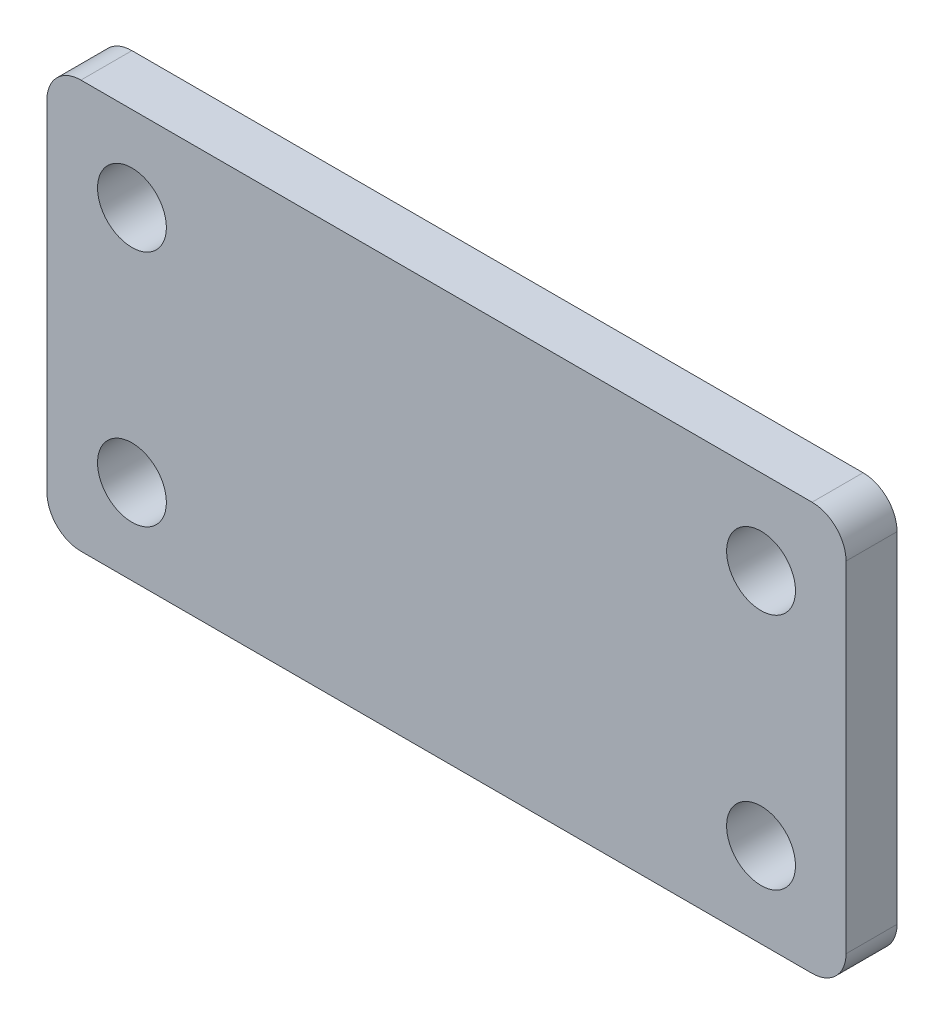
ISO-10303-21;
HEADER;
FILE_DESCRIPTION(('STEP AP214'),'2;1');
FILE_NAME('part.step','',(''),(''),'','','');
FILE_SCHEMA(('AUTOMOTIVE_DESIGN { 1 0 10303 214 1 1 1 1 }'));
ENDSEC;
DATA;
#1=APPLICATION_CONTEXT('core data for automotive mechanical design processes');
#2=APPLICATION_PROTOCOL_DEFINITION('international standard','automotive_design',2000,#1);
#3=PRODUCT_CONTEXT('',#1,'mechanical');
#4=PRODUCT('Part','Part','',(#3));
#5=PRODUCT_RELATED_PRODUCT_CATEGORY('part','',(#4));
#6=PRODUCT_DEFINITION_FORMATION('','',#4);
#7=PRODUCT_DEFINITION_CONTEXT('part definition',#1,'design');
#8=PRODUCT_DEFINITION('design','',#6,#7);
#9=PRODUCT_DEFINITION_SHAPE('','',#8);
#10=(LENGTH_UNIT() NAMED_UNIT(*) SI_UNIT(.MILLI.,.METRE.));
#11=(NAMED_UNIT(*) PLANE_ANGLE_UNIT() SI_UNIT($,.RADIAN.));
#12=(NAMED_UNIT(*) SI_UNIT($,.STERADIAN.) SOLID_ANGLE_UNIT());
#13=UNCERTAINTY_MEASURE_WITH_UNIT(LENGTH_MEASURE(1.E-05),#10,'distance_accuracy_value','');
#14=(GEOMETRIC_REPRESENTATION_CONTEXT(3) GLOBAL_UNCERTAINTY_ASSIGNED_CONTEXT((#13)) GLOBAL_UNIT_ASSIGNED_CONTEXT((#10,
#11,#12)) REPRESENTATION_CONTEXT('',''));
#15=CARTESIAN_POINT('',(0.,0.,0.));
#16=DIRECTION('',(0.,0.,1.));
#17=DIRECTION('',(1.,0.,0.));
#18=AXIS2_PLACEMENT_3D('',#15,#16,#17);
#19=CARTESIAN_POINT('',(0.,0.,3.));
#20=DIRECTION('',(0.,0.,-1.));
#21=DIRECTION('',(-1.,0.,0.));
#22=AXIS2_PLACEMENT_3D('',#19,#20,#21);
#23=PLANE('',#22);
#24=DIRECTION('',(1.,0.,0.));
#25=VECTOR('',#24,1.);
#26=CARTESIAN_POINT('',(-23.5,-12.,3.));
#27=LINE('',#26,#25);
#28=CARTESIAN_POINT('',(-21.5,-12.,3.));
#29=VERTEX_POINT('',#28);
#30=CARTESIAN_POINT('',(21.5,-12.,3.));
#31=VERTEX_POINT('',#30);
#32=EDGE_CURVE('E138',#29,#31,#27,.T.);
#33=ORIENTED_EDGE('',*,*,#32,.T.);
#34=CARTESIAN_POINT('',(21.5,-10.,3.));
#35=DIRECTION('',(0.,0.,-1.));
#36=DIRECTION('',(-1.,0.,0.));
#37=AXIS2_PLACEMENT_3D('',#34,#35,#36);
#38=CIRCLE('',#37,2.);
#39=CARTESIAN_POINT('',(23.5,-10.,3.));
#40=VERTEX_POINT('',#39);
#41=EDGE_CURVE('E157',#31,#40,#38,.F.);
#42=ORIENTED_EDGE('',*,*,#41,.T.);
#43=DIRECTION('',(0.,1.,0.));
#44=VECTOR('',#43,1.);
#45=CARTESIAN_POINT('',(23.5,-12.,3.));
#46=LINE('',#45,#44);
#47=CARTESIAN_POINT('',(23.5,10.,3.));
#48=VERTEX_POINT('',#47);
#49=EDGE_CURVE('E121',#40,#48,#46,.T.);
#50=ORIENTED_EDGE('',*,*,#49,.T.);
#51=CARTESIAN_POINT('',(21.5,10.,3.));
#52=DIRECTION('',(0.,0.,-1.));
#53=DIRECTION('',(-1.,0.,0.));
#54=AXIS2_PLACEMENT_3D('',#51,#52,#53);
#55=CIRCLE('',#54,2.);
#56=CARTESIAN_POINT('',(21.5,12.,3.));
#57=VERTEX_POINT('',#56);
#58=EDGE_CURVE('E152',#48,#57,#55,.F.);
#59=ORIENTED_EDGE('',*,*,#58,.T.);
#60=DIRECTION('',(-1.,0.,0.));
#61=VECTOR('',#60,1.);
#62=CARTESIAN_POINT('',(-23.5,12.,3.));
#63=LINE('',#62,#61);
#64=CARTESIAN_POINT('',(-21.5,12.,3.));
#65=VERTEX_POINT('',#64);
#66=EDGE_CURVE('E168',#57,#65,#63,.T.);
#67=ORIENTED_EDGE('',*,*,#66,.T.);
#68=CARTESIAN_POINT('',(-21.5,10.,3.));
#69=DIRECTION('',(0.,0.,-1.));
#70=DIRECTION('',(-1.,0.,0.));
#71=AXIS2_PLACEMENT_3D('',#68,#69,#70);
#72=CIRCLE('',#71,2.);
#73=CARTESIAN_POINT('',(-23.5,10.,3.));
#74=VERTEX_POINT('',#73);
#75=EDGE_CURVE('E57',#65,#74,#72,.F.);
#76=ORIENTED_EDGE('',*,*,#75,.T.);
#77=DIRECTION('',(0.,-1.,0.));
#78=VECTOR('',#77,1.);
#79=CARTESIAN_POINT('',(-23.5,-12.,3.));
#80=LINE('',#79,#78);
#81=CARTESIAN_POINT('',(-23.5,-10.,3.));
#82=VERTEX_POINT('',#81);
#83=EDGE_CURVE('E176',#74,#82,#80,.T.);
#84=ORIENTED_EDGE('',*,*,#83,.T.);
#85=CARTESIAN_POINT('',(-21.5,-10.,3.));
#86=DIRECTION('',(0.,0.,-1.));
#87=DIRECTION('',(-1.,0.,0.));
#88=AXIS2_PLACEMENT_3D('',#85,#86,#87);
#89=CIRCLE('',#88,2.);
#90=EDGE_CURVE('E155',#82,#29,#89,.F.);
#91=ORIENTED_EDGE('',*,*,#90,.T.);
#92=EDGE_LOOP('',(#33,#42,#50,#59,#67,#76,#84,#91));
#93=FACE_BOUND('',#92,.T.);
#94=CARTESIAN_POINT('',(18.5,7.,3.));
#95=DIRECTION('',(0.,0.,1.));
#96=DIRECTION('',(1.,0.,0.));
#97=AXIS2_PLACEMENT_3D('',#94,#95,#96);
#98=CIRCLE('',#97,2.025);
#99=CARTESIAN_POINT('',(20.525,7.,3.));
#100=VERTEX_POINT('',#99);
#101=EDGE_CURVE('E129',#100,#100,#98,.T.);
#102=ORIENTED_EDGE('',*,*,#101,.F.);
#103=EDGE_LOOP('',(#102));
#104=FACE_BOUND('',#103,.T.);
#105=CARTESIAN_POINT('',(-18.5,7.,3.));
#106=DIRECTION('',(0.,0.,1.));
#107=DIRECTION('',(1.,0.,0.));
#108=AXIS2_PLACEMENT_3D('',#105,#106,#107);
#109=CIRCLE('',#108,2.025);
#110=CARTESIAN_POINT('',(-16.475,7.,3.));
#111=VERTEX_POINT('',#110);
#112=EDGE_CURVE('E183',#111,#111,#109,.T.);
#113=ORIENTED_EDGE('',*,*,#112,.F.);
#114=EDGE_LOOP('',(#113));
#115=FACE_BOUND('',#114,.T.);
#116=CARTESIAN_POINT('',(-18.5,-7.,3.));
#117=DIRECTION('',(0.,0.,1.));
#118=DIRECTION('',(1.,0.,0.));
#119=AXIS2_PLACEMENT_3D('',#116,#117,#118);
#120=CIRCLE('',#119,2.025);
#121=CARTESIAN_POINT('',(-16.475,-7.,3.));
#122=VERTEX_POINT('',#121);
#123=EDGE_CURVE('E188',#122,#122,#120,.T.);
#124=ORIENTED_EDGE('',*,*,#123,.F.);
#125=EDGE_LOOP('',(#124));
#126=FACE_BOUND('',#125,.T.);
#127=CARTESIAN_POINT('',(18.5,-7.,3.));
#128=DIRECTION('',(0.,0.,1.));
#129=DIRECTION('',(1.,0.,0.));
#130=AXIS2_PLACEMENT_3D('',#127,#128,#129);
#131=CIRCLE('',#130,2.025);
#132=CARTESIAN_POINT('',(20.525,-7.,3.));
#133=VERTEX_POINT('',#132);
#134=EDGE_CURVE('E194',#133,#133,#131,.T.);
#135=ORIENTED_EDGE('',*,*,#134,.F.);
#136=EDGE_LOOP('',(#135));
#137=FACE_BOUND('',#136,.T.);
#138=ADVANCED_FACE('F35',(#93,#104,#115,#126,#137),#23,.F.);
#139=CARTESIAN_POINT('',(0.,0.,0.));
#140=DIRECTION('',(0.,0.,-1.));
#141=DIRECTION('',(-1.,0.,0.));
#142=AXIS2_PLACEMENT_3D('',#139,#140,#141);
#143=PLANE('',#142);
#144=CARTESIAN_POINT('',(-18.5,-7.,0.));
#145=DIRECTION('',(0.,0.,1.));
#146=DIRECTION('',(1.,0.,0.));
#147=AXIS2_PLACEMENT_3D('',#144,#145,#146);
#148=CIRCLE('',#147,2.025);
#149=CARTESIAN_POINT('',(-16.475,-7.,0.));
#150=VERTEX_POINT('',#149);
#151=EDGE_CURVE('E191',#150,#150,#148,.T.);
#152=ORIENTED_EDGE('',*,*,#151,.T.);
#153=EDGE_LOOP('',(#152));
#154=FACE_BOUND('',#153,.T.);
#155=CARTESIAN_POINT('',(18.5,7.,0.));
#156=DIRECTION('',(0.,0.,1.));
#157=DIRECTION('',(1.,0.,0.));
#158=AXIS2_PLACEMENT_3D('',#155,#156,#157);
#159=CIRCLE('',#158,2.025);
#160=CARTESIAN_POINT('',(20.525,7.,0.));
#161=VERTEX_POINT('',#160);
#162=EDGE_CURVE('E135',#161,#161,#159,.T.);
#163=ORIENTED_EDGE('',*,*,#162,.T.);
#164=EDGE_LOOP('',(#163));
#165=FACE_BOUND('',#164,.T.);
#166=DIRECTION('',(0.,1.,0.));
#167=VECTOR('',#166,1.);
#168=CARTESIAN_POINT('',(23.5,-12.,0.));
#169=LINE('',#168,#167);
#170=CARTESIAN_POINT('',(23.5,-10.,0.));
#171=VERTEX_POINT('',#170);
#172=CARTESIAN_POINT('',(23.5,10.,0.));
#173=VERTEX_POINT('',#172);
#174=EDGE_CURVE('E118',#171,#173,#169,.T.);
#175=ORIENTED_EDGE('',*,*,#174,.F.);
#176=CARTESIAN_POINT('',(21.5,-10.,0.));
#177=DIRECTION('',(0.,0.,-1.));
#178=DIRECTION('',(-1.,0.,0.));
#179=AXIS2_PLACEMENT_3D('',#176,#177,#178);
#180=CIRCLE('',#179,2.);
#181=CARTESIAN_POINT('',(21.5,-12.,0.));
#182=VERTEX_POINT('',#181);
#183=EDGE_CURVE('E101',#171,#182,#180,.T.);
#184=ORIENTED_EDGE('',*,*,#183,.T.);
#185=DIRECTION('',(1.,0.,0.));
#186=VECTOR('',#185,1.);
#187=CARTESIAN_POINT('',(-23.5,-12.,0.));
#188=LINE('',#187,#186);
#189=CARTESIAN_POINT('',(-21.5,-12.,0.));
#190=VERTEX_POINT('',#189);
#191=EDGE_CURVE('E142',#190,#182,#188,.T.);
#192=ORIENTED_EDGE('',*,*,#191,.F.);
#193=CARTESIAN_POINT('',(-21.5,-10.,0.));
#194=DIRECTION('',(0.,0.,-1.));
#195=DIRECTION('',(-1.,0.,0.));
#196=AXIS2_PLACEMENT_3D('',#193,#194,#195);
#197=CIRCLE('',#196,2.);
#198=CARTESIAN_POINT('',(-23.5,-10.,0.));
#199=VERTEX_POINT('',#198);
#200=EDGE_CURVE('E112',#190,#199,#197,.T.);
#201=ORIENTED_EDGE('',*,*,#200,.T.);
#202=DIRECTION('',(0.,-1.,0.));
#203=VECTOR('',#202,1.);
#204=CARTESIAN_POINT('',(-23.5,-12.,0.));
#205=LINE('',#204,#203);
#206=CARTESIAN_POINT('',(-23.5,10.,0.));
#207=VERTEX_POINT('',#206);
#208=EDGE_CURVE('E132',#207,#199,#205,.T.);
#209=ORIENTED_EDGE('',*,*,#208,.F.);
#210=CARTESIAN_POINT('',(-21.5,10.,0.));
#211=DIRECTION('',(0.,0.,-1.));
#212=DIRECTION('',(-1.,0.,0.));
#213=AXIS2_PLACEMENT_3D('',#210,#211,#212);
#214=CIRCLE('',#213,2.);
#215=CARTESIAN_POINT('',(-21.5,12.,0.));
#216=VERTEX_POINT('',#215);
#217=EDGE_CURVE('E146',#207,#216,#214,.T.);
#218=ORIENTED_EDGE('',*,*,#217,.T.);
#219=DIRECTION('',(-1.,0.,0.));
#220=VECTOR('',#219,1.);
#221=CARTESIAN_POINT('',(-23.5,12.,0.));
#222=LINE('',#221,#220);
#223=CARTESIAN_POINT('',(21.5,12.,0.));
#224=VERTEX_POINT('',#223);
#225=EDGE_CURVE('E128',#224,#216,#222,.T.);
#226=ORIENTED_EDGE('',*,*,#225,.F.);
#227=CARTESIAN_POINT('',(21.5,10.,0.));
#228=DIRECTION('',(0.,0.,-1.));
#229=DIRECTION('',(-1.,0.,0.));
#230=AXIS2_PLACEMENT_3D('',#227,#228,#229);
#231=CIRCLE('',#230,2.);
#232=EDGE_CURVE('E122',#224,#173,#231,.T.);
#233=ORIENTED_EDGE('',*,*,#232,.T.);
#234=EDGE_LOOP('',(#175,#184,#192,#201,#209,#218,#226,#233));
#235=FACE_BOUND('',#234,.T.);
#236=CARTESIAN_POINT('',(-18.5,7.,0.));
#237=DIRECTION('',(0.,0.,1.));
#238=DIRECTION('',(1.,0.,0.));
#239=AXIS2_PLACEMENT_3D('',#236,#237,#238);
#240=CIRCLE('',#239,2.025);
#241=CARTESIAN_POINT('',(-16.475,7.,0.));
#242=VERTEX_POINT('',#241);
#243=EDGE_CURVE('E185',#242,#242,#240,.T.);
#244=ORIENTED_EDGE('',*,*,#243,.T.);
#245=EDGE_LOOP('',(#244));
#246=FACE_BOUND('',#245,.T.);
#247=CARTESIAN_POINT('',(18.5,-7.,0.));
#248=DIRECTION('',(0.,0.,1.));
#249=DIRECTION('',(1.,0.,0.));
#250=AXIS2_PLACEMENT_3D('',#247,#248,#249);
#251=CIRCLE('',#250,2.025);
#252=CARTESIAN_POINT('',(20.525,-7.,0.));
#253=VERTEX_POINT('',#252);
#254=EDGE_CURVE('E197',#253,#253,#251,.T.);
#255=ORIENTED_EDGE('',*,*,#254,.T.);
#256=EDGE_LOOP('',(#255));
#257=FACE_BOUND('',#256,.T.);
#258=ADVANCED_FACE('F125',(#154,#165,#235,#246,#257),#143,.T.);
#259=CARTESIAN_POINT('',(23.5,-12.,3.));
#260=DIRECTION('',(-1.,0.,0.));
#261=DIRECTION('',(0.,0.,1.));
#262=AXIS2_PLACEMENT_3D('',#259,#260,#261);
#263=PLANE('',#262);
#264=ORIENTED_EDGE('',*,*,#49,.F.);
#265=DIRECTION('',(0.,0.,-1.));
#266=VECTOR('',#265,1.);
#267=CARTESIAN_POINT('',(23.5,-10.,3.));
#268=LINE('',#267,#266);
#269=EDGE_CURVE('E105',#40,#171,#268,.T.);
#270=ORIENTED_EDGE('',*,*,#269,.T.);
#271=ORIENTED_EDGE('',*,*,#174,.T.);
#272=DIRECTION('',(0.,0.,-1.));
#273=VECTOR('',#272,1.);
#274=CARTESIAN_POINT('',(23.5,10.,3.));
#275=LINE('',#274,#273);
#276=EDGE_CURVE('E123',#173,#48,#275,.F.);
#277=ORIENTED_EDGE('',*,*,#276,.T.);
#278=EDGE_LOOP('',(#264,#270,#271,#277));
#279=FACE_BOUND('',#278,.T.);
#280=ADVANCED_FACE('F117',(#279),#263,.F.);
#281=CARTESIAN_POINT('',(-23.5,12.,3.));
#282=DIRECTION('',(0.,-1.,0.));
#283=DIRECTION('',(1.,0.,0.));
#284=AXIS2_PLACEMENT_3D('',#281,#282,#283);
#285=PLANE('',#284);
#286=ORIENTED_EDGE('',*,*,#225,.T.);
#287=DIRECTION('',(0.,0.,-1.));
#288=VECTOR('',#287,1.);
#289=CARTESIAN_POINT('',(-21.5,12.,3.));
#290=LINE('',#289,#288);
#291=EDGE_CURVE('E11',#216,#65,#290,.F.);
#292=ORIENTED_EDGE('',*,*,#291,.T.);
#293=ORIENTED_EDGE('',*,*,#66,.F.);
#294=DIRECTION('',(0.,0.,-1.));
#295=VECTOR('',#294,1.);
#296=CARTESIAN_POINT('',(21.5,12.,3.));
#297=LINE('',#296,#295);
#298=EDGE_CURVE('E43',#57,#224,#297,.T.);
#299=ORIENTED_EDGE('',*,*,#298,.T.);
#300=EDGE_LOOP('',(#286,#292,#293,#299));
#301=FACE_BOUND('',#300,.T.);
#302=ADVANCED_FACE('F166',(#301),#285,.F.);
#303=CARTESIAN_POINT('',(-23.5,-12.,3.));
#304=DIRECTION('',(1.,0.,0.));
#305=DIRECTION('',(0.,1.,0.));
#306=AXIS2_PLACEMENT_3D('',#303,#304,#305);
#307=PLANE('',#306);
#308=ORIENTED_EDGE('',*,*,#208,.T.);
#309=DIRECTION('',(0.,0.,-1.));
#310=VECTOR('',#309,1.);
#311=CARTESIAN_POINT('',(-23.5,-10.,3.));
#312=LINE('',#311,#310);
#313=EDGE_CURVE('E50',#199,#82,#312,.F.);
#314=ORIENTED_EDGE('',*,*,#313,.T.);
#315=ORIENTED_EDGE('',*,*,#83,.F.);
#316=DIRECTION('',(0.,0.,-1.));
#317=VECTOR('',#316,1.);
#318=CARTESIAN_POINT('',(-23.5,10.,3.));
#319=LINE('',#318,#317);
#320=EDGE_CURVE('E159',#74,#207,#319,.T.);
#321=ORIENTED_EDGE('',*,*,#320,.T.);
#322=EDGE_LOOP('',(#308,#314,#315,#321));
#323=FACE_BOUND('',#322,.T.);
#324=ADVANCED_FACE('F175',(#323),#307,.F.);
#325=CARTESIAN_POINT('',(-23.5,-12.,3.));
#326=DIRECTION('',(0.,1.,0.));
#327=DIRECTION('',(-1.,0.,0.));
#328=AXIS2_PLACEMENT_3D('',#325,#326,#327);
#329=PLANE('',#328);
#330=ORIENTED_EDGE('',*,*,#191,.T.);
#331=DIRECTION('',(0.,0.,-1.));
#332=VECTOR('',#331,1.);
#333=CARTESIAN_POINT('',(21.5,-12.,3.));
#334=LINE('',#333,#332);
#335=EDGE_CURVE('E106',#182,#31,#334,.F.);
#336=ORIENTED_EDGE('',*,*,#335,.T.);
#337=ORIENTED_EDGE('',*,*,#32,.F.);
#338=DIRECTION('',(0.,0.,-1.));
#339=VECTOR('',#338,1.);
#340=CARTESIAN_POINT('',(-21.5,-12.,3.));
#341=LINE('',#340,#339);
#342=EDGE_CURVE('E111',#29,#190,#341,.T.);
#343=ORIENTED_EDGE('',*,*,#342,.T.);
#344=EDGE_LOOP('',(#330,#336,#337,#343));
#345=FACE_BOUND('',#344,.T.);
#346=ADVANCED_FACE('F218',(#345),#329,.F.);
#347=CARTESIAN_POINT('',(18.5,7.,3.));
#348=DIRECTION('',(0.,0.,-1.));
#349=DIRECTION('',(-1.,0.,0.));
#350=AXIS2_PLACEMENT_3D('',#347,#348,#349);
#351=CYLINDRICAL_SURFACE('',#350,2.025);
#352=ORIENTED_EDGE('',*,*,#101,.T.);
#353=EDGE_LOOP('',(#352));
#354=FACE_BOUND('',#353,.T.);
#355=ORIENTED_EDGE('',*,*,#162,.F.);
#356=EDGE_LOOP('',(#355));
#357=FACE_BOUND('',#356,.T.);
#358=ADVANCED_FACE('F215',(#354,#357),#351,.F.);
#359=CARTESIAN_POINT('',(-18.5,7.,3.));
#360=DIRECTION('',(0.,0.,-1.));
#361=DIRECTION('',(-1.,0.,0.));
#362=AXIS2_PLACEMENT_3D('',#359,#360,#361);
#363=CYLINDRICAL_SURFACE('',#362,2.025);
#364=ORIENTED_EDGE('',*,*,#112,.T.);
#365=EDGE_LOOP('',(#364));
#366=FACE_BOUND('',#365,.T.);
#367=ORIENTED_EDGE('',*,*,#243,.F.);
#368=EDGE_LOOP('',(#367));
#369=FACE_BOUND('',#368,.T.);
#370=ADVANCED_FACE('F311',(#366,#369),#363,.F.);
#371=CARTESIAN_POINT('',(-18.5,-7.,3.));
#372=DIRECTION('',(0.,0.,-1.));
#373=DIRECTION('',(-1.,0.,0.));
#374=AXIS2_PLACEMENT_3D('',#371,#372,#373);
#375=CYLINDRICAL_SURFACE('',#374,2.025);
#376=ORIENTED_EDGE('',*,*,#123,.T.);
#377=EDGE_LOOP('',(#376));
#378=FACE_BOUND('',#377,.T.);
#379=ORIENTED_EDGE('',*,*,#151,.F.);
#380=EDGE_LOOP('',(#379));
#381=FACE_BOUND('',#380,.T.);
#382=ADVANCED_FACE('F302',(#378,#381),#375,.F.);
#383=CARTESIAN_POINT('',(18.5,-7.,3.));
#384=DIRECTION('',(0.,0.,-1.));
#385=DIRECTION('',(-1.,0.,0.));
#386=AXIS2_PLACEMENT_3D('',#383,#384,#385);
#387=CYLINDRICAL_SURFACE('',#386,2.025);
#388=ORIENTED_EDGE('',*,*,#134,.T.);
#389=EDGE_LOOP('',(#388));
#390=FACE_BOUND('',#389,.T.);
#391=ORIENTED_EDGE('',*,*,#254,.F.);
#392=EDGE_LOOP('',(#391));
#393=FACE_BOUND('',#392,.T.);
#394=ADVANCED_FACE('F203',(#390,#393),#387,.F.);
#395=CARTESIAN_POINT('',(21.5,-10.,3.));
#396=DIRECTION('',(0.,0.,-1.));
#397=DIRECTION('',(-1.,0.,0.));
#398=AXIS2_PLACEMENT_3D('',#395,#396,#397);
#399=CYLINDRICAL_SURFACE('',#398,2.);
#400=ORIENTED_EDGE('',*,*,#41,.F.);
#401=ORIENTED_EDGE('',*,*,#335,.F.);
#402=ORIENTED_EDGE('',*,*,#183,.F.);
#403=ORIENTED_EDGE('',*,*,#269,.F.);
#404=EDGE_LOOP('',(#400,#401,#402,#403));
#405=FACE_BOUND('',#404,.T.);
#406=ADVANCED_FACE('F104',(#405),#399,.T.);
#407=CARTESIAN_POINT('',(-21.5,-10.,3.));
#408=DIRECTION('',(0.,0.,-1.));
#409=DIRECTION('',(-1.,0.,0.));
#410=AXIS2_PLACEMENT_3D('',#407,#408,#409);
#411=CYLINDRICAL_SURFACE('',#410,2.);
#412=ORIENTED_EDGE('',*,*,#90,.F.);
#413=ORIENTED_EDGE('',*,*,#313,.F.);
#414=ORIENTED_EDGE('',*,*,#200,.F.);
#415=ORIENTED_EDGE('',*,*,#342,.F.);
#416=EDGE_LOOP('',(#412,#413,#414,#415));
#417=FACE_BOUND('',#416,.T.);
#418=ADVANCED_FACE('F230',(#417),#411,.T.);
#419=CARTESIAN_POINT('',(-21.5,10.,3.));
#420=DIRECTION('',(0.,0.,-1.));
#421=DIRECTION('',(-1.,0.,0.));
#422=AXIS2_PLACEMENT_3D('',#419,#420,#421);
#423=CYLINDRICAL_SURFACE('',#422,2.);
#424=ORIENTED_EDGE('',*,*,#75,.F.);
#425=ORIENTED_EDGE('',*,*,#291,.F.);
#426=ORIENTED_EDGE('',*,*,#217,.F.);
#427=ORIENTED_EDGE('',*,*,#320,.F.);
#428=EDGE_LOOP('',(#424,#425,#426,#427));
#429=FACE_BOUND('',#428,.T.);
#430=ADVANCED_FACE('F174',(#429),#423,.T.);
#431=CARTESIAN_POINT('',(21.5,10.,3.));
#432=DIRECTION('',(0.,0.,-1.));
#433=DIRECTION('',(-1.,0.,0.));
#434=AXIS2_PLACEMENT_3D('',#431,#432,#433);
#435=CYLINDRICAL_SURFACE('',#434,2.);
#436=ORIENTED_EDGE('',*,*,#58,.F.);
#437=ORIENTED_EDGE('',*,*,#276,.F.);
#438=ORIENTED_EDGE('',*,*,#232,.F.);
#439=ORIENTED_EDGE('',*,*,#298,.F.);
#440=EDGE_LOOP('',(#436,#437,#438,#439));
#441=FACE_BOUND('',#440,.T.);
#442=ADVANCED_FACE('F37',(#441),#435,.T.);
#443=CLOSED_SHELL('',(#138,#258,#280,#302,#324,#346,#358,#370,#382,#394,#406,#418,#430,#442));
#444=MANIFOLD_SOLID_BREP('B2',#443);
#445=ADVANCED_BREP_SHAPE_REPRESENTATION('',(#18,#444),#14);
#446=SHAPE_DEFINITION_REPRESENTATION(#9,#445);
ENDSEC;
END-ISO-10303-21;
